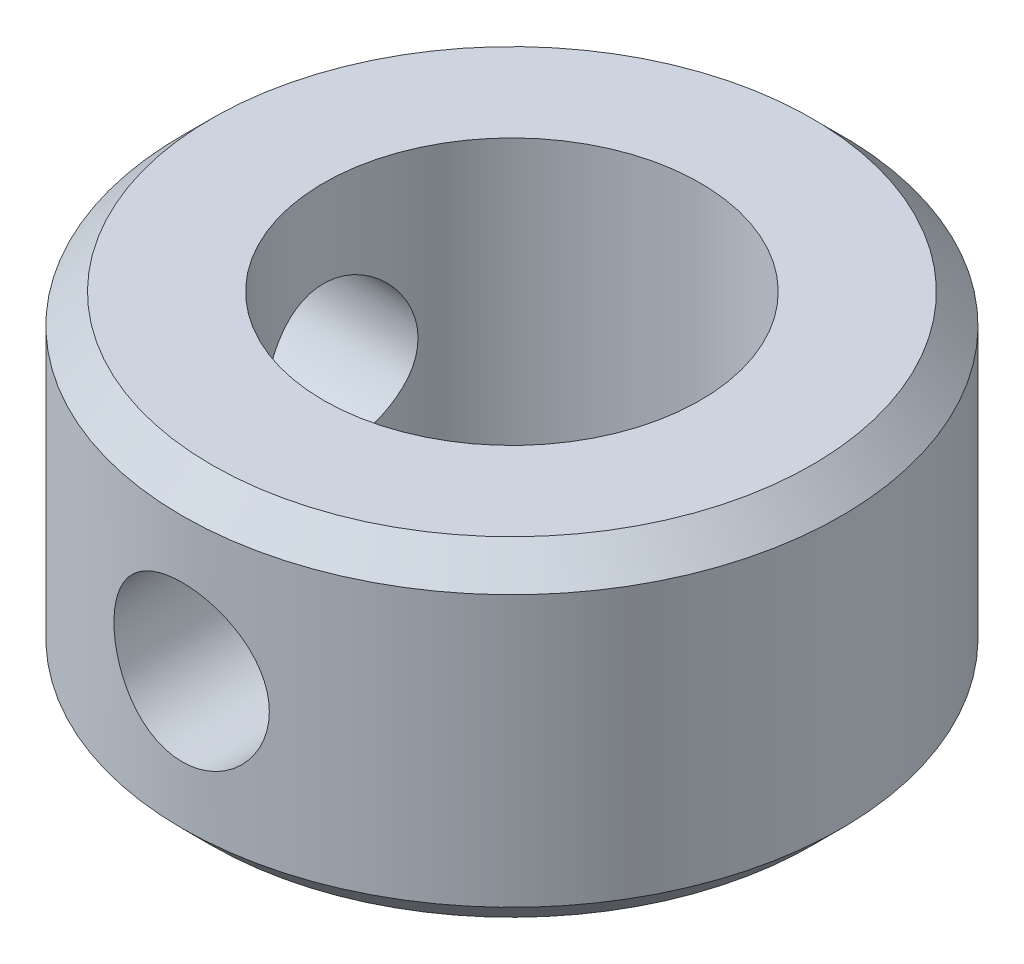
ISO-10303-21;
HEADER;
FILE_DESCRIPTION(('STEP AP214'),'2;1');
FILE_NAME('part.step','',(''),(''),'','','');
FILE_SCHEMA(('AUTOMOTIVE_DESIGN { 1 0 10303 214 1 1 1 1 }'));
ENDSEC;
DATA;
#1=APPLICATION_CONTEXT('core data for automotive mechanical design processes');
#2=APPLICATION_PROTOCOL_DEFINITION('international standard','automotive_design',2000,#1);
#3=PRODUCT_CONTEXT('',#1,'mechanical');
#4=PRODUCT('Part','Part','',(#3));
#5=PRODUCT_RELATED_PRODUCT_CATEGORY('part','',(#4));
#6=PRODUCT_DEFINITION_FORMATION('','',#4);
#7=PRODUCT_DEFINITION_CONTEXT('part definition',#1,'design');
#8=PRODUCT_DEFINITION('design','',#6,#7);
#9=PRODUCT_DEFINITION_SHAPE('','',#8);
#10=(LENGTH_UNIT() NAMED_UNIT(*) SI_UNIT(.MILLI.,.METRE.));
#11=(NAMED_UNIT(*) PLANE_ANGLE_UNIT() SI_UNIT($,.RADIAN.));
#12=(NAMED_UNIT(*) SI_UNIT($,.STERADIAN.) SOLID_ANGLE_UNIT());
#13=UNCERTAINTY_MEASURE_WITH_UNIT(LENGTH_MEASURE(1.E-05),#10,'distance_accuracy_value','');
#14=(GEOMETRIC_REPRESENTATION_CONTEXT(3) GLOBAL_UNCERTAINTY_ASSIGNED_CONTEXT((#13)) GLOBAL_UNIT_ASSIGNED_CONTEXT((#10,
#11,#12)) REPRESENTATION_CONTEXT('',''));
#15=CARTESIAN_POINT('',(0.,0.,0.));
#16=DIRECTION('',(0.,0.,1.));
#17=DIRECTION('',(1.,0.,0.));
#18=AXIS2_PLACEMENT_3D('',#15,#16,#17);
#19=CARTESIAN_POINT('',(0.,3.5,0.));
#20=DIRECTION('',(0.,1.,0.));
#21=DIRECTION('',(0.,0.,1.));
#22=AXIS2_PLACEMENT_3D('',#19,#20,#21);
#23=PLANE('',#22);
#24=CARTESIAN_POINT('',(0.,3.5,0.));
#25=DIRECTION('',(0.,1.,0.));
#26=DIRECTION('',(0.,0.,1.));
#27=AXIS2_PLACEMENT_3D('',#24,#25,#26);
#28=CIRCLE('',#27,6.375);
#29=CARTESIAN_POINT('',(0.,3.5,6.375));
#30=VERTEX_POINT('',#29);
#31=EDGE_CURVE('E10',#30,#30,#28,.T.);
#32=ORIENTED_EDGE('',*,*,#31,.T.);
#33=EDGE_LOOP('',(#32));
#34=FACE_BOUND('',#33,.T.);
#35=CARTESIAN_POINT('',(0.,3.5,0.));
#36=DIRECTION('',(0.,1.,0.));
#37=DIRECTION('',(0.,0.,1.));
#38=AXIS2_PLACEMENT_3D('',#35,#36,#37);
#39=CIRCLE('',#38,4.);
#40=CARTESIAN_POINT('',(0.,3.5,4.));
#41=VERTEX_POINT('',#40);
#42=EDGE_CURVE('E68',#41,#41,#39,.T.);
#43=ORIENTED_EDGE('',*,*,#42,.F.);
#44=EDGE_LOOP('',(#43));
#45=FACE_BOUND('',#44,.T.);
#46=ADVANCED_FACE('F47',(#34,#45),#23,.T.);
#47=CARTESIAN_POINT('',(0.,-3.5,0.));
#48=DIRECTION('',(0.,1.,0.));
#49=DIRECTION('',(0.,0.,1.));
#50=AXIS2_PLACEMENT_3D('',#47,#48,#49);
#51=PLANE('',#50);
#52=CARTESIAN_POINT('',(0.,-3.5,0.));
#53=DIRECTION('',(0.,1.,0.));
#54=DIRECTION('',(0.,0.,1.));
#55=AXIS2_PLACEMENT_3D('',#52,#53,#54);
#56=CIRCLE('',#55,6.375);
#57=CARTESIAN_POINT('',(0.,-3.5,6.375));
#58=VERTEX_POINT('',#57);
#59=EDGE_CURVE('E55',#58,#58,#56,.F.);
#60=ORIENTED_EDGE('',*,*,#59,.T.);
#61=EDGE_LOOP('',(#60));
#62=FACE_BOUND('',#61,.T.);
#63=CARTESIAN_POINT('',(0.,-3.5,0.));
#64=DIRECTION('',(0.,1.,0.));
#65=DIRECTION('',(0.,0.,1.));
#66=AXIS2_PLACEMENT_3D('',#63,#64,#65);
#67=CIRCLE('',#66,4.);
#68=CARTESIAN_POINT('',(0.,-3.5,4.));
#69=VERTEX_POINT('',#68);
#70=EDGE_CURVE('E69',#69,#69,#67,.T.);
#71=ORIENTED_EDGE('',*,*,#70,.T.);
#72=EDGE_LOOP('',(#71));
#73=FACE_BOUND('',#72,.T.);
#74=ADVANCED_FACE('F107',(#62,#73),#51,.F.);
#75=CARTESIAN_POINT('',(0.,3.5,0.));
#76=DIRECTION('',(0.,-1.,0.));
#77=DIRECTION('',(0.,0.,-1.));
#78=AXIS2_PLACEMENT_3D('',#75,#76,#77);
#79=CYLINDRICAL_SURFACE('',#78,7.);
#80=CARTESIAN_POINT('',(-6.80275679412399,0.,1.64999999999998));
#81=CARTESIAN_POINT('',(-6.80275861136206,-0.0912890000234779,1.64999713007314));
#82=CARTESIAN_POINT('',(-6.80461440498174,-0.182610998381094,1.64239813439993));
#83=CARTESIAN_POINT('',(-6.81182064992734,-0.362644563434028,1.61224414767595));
#84=CARTESIAN_POINT('',(-6.81717336620826,-0.451354399288549,1.58967946321203));
#85=CARTESIAN_POINT('',(-6.83073431325552,-0.623533512523368,1.53035515036091));
#86=CARTESIAN_POINT('',(-6.83893911932178,-0.707008933959494,1.49361254058447));
#87=CARTESIAN_POINT('',(-6.85727558075245,-0.866616532790047,1.40702581854955));
#88=CARTESIAN_POINT('',(-6.86740726130098,-0.942748614187931,1.35718153504988));
#89=CARTESIAN_POINT('',(-6.88867782513988,-1.08699982868594,1.24476461908349));
#90=CARTESIAN_POINT('',(-6.89983131541128,-1.15495404527719,1.18198309355865));
#91=CARTESIAN_POINT('',(-6.92176152937785,-1.27947171170117,1.04592427298926));
#92=CARTESIAN_POINT('',(-6.93253822068664,-1.33603418437752,0.972646078487472));
#93=CARTESIAN_POINT('',(-6.95266103704035,-1.43682696981727,0.816555491676971));
#94=CARTESIAN_POINT('',(-6.96198791366554,-1.48089686123284,0.73363681447964));
#95=CARTESIAN_POINT('',(-6.97799434603916,-1.55441290827776,0.561312838562611));
#96=CARTESIAN_POINT('',(-6.98467424785277,-1.58386097569016,0.471908389601348));
#97=CARTESIAN_POINT('',(-6.99453084372035,-1.62677370217112,0.29086802205239));
#98=CARTESIAN_POINT('',(-6.99776875317269,-1.64051799396695,0.199301775715435));
#99=CARTESIAN_POINT('',(-7.00058928212562,-1.65250913676126,0.015109783907853));
#100=CARTESIAN_POINT('',(-7.00017238432294,-1.65075803426303,-0.0775158200378599));
#101=CARTESIAN_POINT('',(-6.99577641572093,-1.63201259498984,-0.259263367840057));
#102=CARTESIAN_POINT('',(-6.99186783471482,-1.61531988499546,-0.348418380319093));
#103=CARTESIAN_POINT('',(-6.98100889430398,-1.56764792556426,-0.522624624983785));
#104=CARTESIAN_POINT('',(-6.97405838372646,-1.53666796609913,-0.607675652983124));
#105=CARTESIAN_POINT('',(-6.95778608866946,-1.46104622960672,-0.772074386794576));
#106=CARTESIAN_POINT('',(-6.94844521053821,-1.41629382953033,-0.851369239725069));
#107=CARTESIAN_POINT('',(-6.92841069918987,-1.31448077411501,-1.00143136070303));
#108=CARTESIAN_POINT('',(-6.91771685448099,-1.25741819349895,-1.07219729215005));
#109=CARTESIAN_POINT('',(-6.89584251761334,-1.13097547490599,-1.20498965605835));
#110=CARTESIAN_POINT('',(-6.88465650871199,-1.06133150430551,-1.26676421005728));
#111=CARTESIAN_POINT('',(-6.8632971795881,-0.912555678850197,-1.37780936391996));
#112=CARTESIAN_POINT('',(-6.85312389657327,-0.83342347563159,-1.42707950447268));
#113=CARTESIAN_POINT('',(-6.83492437266262,-0.667464740192945,-1.51185477157776));
#114=CARTESIAN_POINT('',(-6.82690665922474,-0.580609406049146,-1.54730546989211));
#115=CARTESIAN_POINT('',(-6.8140390867396,-0.40193872243084,-1.60302771512783));
#116=CARTESIAN_POINT('',(-6.80918863409246,-0.31012430586923,-1.62330210645791));
#117=CARTESIAN_POINT('',(-6.80332774943588,-0.12646144305076,-1.64769127898041));
#118=CARTESIAN_POINT('',(-6.80222947433875,-0.0346648402699374,-1.65217579860459));
#119=CARTESIAN_POINT('',(-6.80375919481422,0.148364576583741,-1.64586488795027));
#120=CARTESIAN_POINT('',(-6.80638688917232,0.239597435631894,-1.63507069283236));
#121=CARTESIAN_POINT('',(-6.81498886694796,0.417577450747468,-1.59883140460814));
#122=CARTESIAN_POINT('',(-6.82091521063604,0.504369845653747,-1.5735960425171));
#123=CARTESIAN_POINT('',(-6.83540229380027,0.672493686634514,-1.50942069873875));
#124=CARTESIAN_POINT('',(-6.84396331787599,0.753824541593779,-1.47047923644587));
#125=CARTESIAN_POINT('',(-6.86294389007105,0.910299056589382,-1.37920410959567));
#126=CARTESIAN_POINT('',(-6.87339357272798,0.985308184742531,-1.32664621508519));
#127=CARTESIAN_POINT('',(-6.89489755256542,1.12557800629822,-1.20991829013256));
#128=CARTESIAN_POINT('',(-6.90595193742742,1.19083728083161,-1.14574657256201));
#129=CARTESIAN_POINT('',(-6.92771364919943,1.31122298204255,-1.00592681617984));
#130=CARTESIAN_POINT('',(-6.93840801965821,1.36609535547159,-0.930057660220554));
#131=CARTESIAN_POINT('',(-6.95799159344944,1.46231801677791,-0.769965220758971));
#132=CARTESIAN_POINT('',(-6.96688088727282,1.50366898256505,-0.685742356354583));
#133=CARTESIAN_POINT('',(-6.98179887024889,1.57133783893331,-0.511894272134583));
#134=CARTESIAN_POINT('',(-6.98784709878863,1.59775867456761,-0.422310877248057));
#135=CARTESIAN_POINT('',(-6.99648655479454,1.63513286894146,-0.239816201973873));
#136=CARTESIAN_POINT('',(-6.99907837091255,1.64608886147333,-0.146905491020391));
#137=CARTESIAN_POINT('',(-7.00049202890772,1.65208813057133,0.0372082467747126));
#138=CARTESIAN_POINT('',(-6.9994031706394,1.64750832426096,0.128398504210663));
#139=CARTESIAN_POINT('',(-6.99377268350157,1.62341975270527,0.308670729816493));
#140=CARTESIAN_POINT('',(-6.98923113721447,1.60391134452658,0.397752748359306));
#141=CARTESIAN_POINT('',(-6.97721604451342,1.55071176108928,0.570933576895618));
#142=CARTESIAN_POINT('',(-6.96975517685192,1.51708187051132,0.655052149359122));
#143=CARTESIAN_POINT('',(-6.95269208722048,1.4366509910792,0.816498795364736));
#144=CARTESIAN_POINT('',(-6.94308962308136,1.38984851252764,0.893826099578973));
#145=CARTESIAN_POINT('',(-6.92252474173611,1.28321390355334,1.0413072599721));
#146=CARTESIAN_POINT('',(-6.91153737485731,1.22312153020512,1.11126948147332));
#147=CARTESIAN_POINT('',(-6.88956325338245,1.09212760248887,1.24024523339419));
#148=CARTESIAN_POINT('',(-6.8785764996075,1.02122338274089,1.29925605605593));
#149=CARTESIAN_POINT('',(-6.85764827463158,0.869245406144731,1.40557849643648));
#150=CARTESIAN_POINT('',(-6.84772646444862,0.788026388521302,1.4526866153972));
#151=CARTESIAN_POINT('',(-6.83030721412674,0.618602666246867,1.53250931126196));
#152=CARTESIAN_POINT('',(-6.8228078728753,0.530403507505555,1.56523518241756));
#153=CARTESIAN_POINT('',(-6.81235745600282,0.368530845590517,1.61002842680634));
#154=CARTESIAN_POINT('',(-6.80878274857868,0.295683995155681,1.62498700416514));
#155=CARTESIAN_POINT('',(-6.80398175593831,0.148565318467718,1.64497362976396));
#156=CARTESIAN_POINT('',(-6.80275531520392,0.0742935869089511,1.65000233562813));
#157=CARTESIAN_POINT('',(-6.80275679412399,0.,1.64999999999998));
#158=B_SPLINE_CURVE_WITH_KNOTS('',3,(#80,#81,#82,#83,#84,#85,#86,#87,#88,#89,#90,#91,#92,#93,
#94,#95,#96,#97,#98,#99,#100,#101,#102,#103,#104,#105,#106,#107,#108,#109,#110,#111,#112,#113,
#114,#115,#116,#117,#118,#119,#120,#121,#122,#123,#124,#125,#126,#127,#128,#129,#130,#131,#132,
#133,#134,#135,#136,#137,#138,#139,#140,#141,#142,#143,#144,#145,#146,#147,#148,#149,#150,#151,
#152,#153,#154,#155,#156,#157),.UNSPECIFIED.,.T.,.F.,(4,2,2,2,2,2,2,2,2,2,2,2,2,2,2,2,2,2,2,2,2,
2,2,2,2,2,2,2,2,2,2,2,2,2,2,2,2,2,4),(0.,0.273594440399258,0.547366263700774,0.820810479503744,
1.0942582694491,1.37252656286893,1.65081871531698,1.93253747960749,2.21421939985748,
2.49080324523182,2.76735056224876,3.03843805884697,3.30953902903524,3.5828770280852,
3.85625780745004,4.13623055025586,4.41621357550839,4.69728844125184,4.97831061353603,
5.25270687968443,5.52708096437946,5.79756789407088,6.06808405216623,6.34337456664896,
6.61870510445458,6.90008328124663,7.18144734868653,7.46084693391317,7.74019892930651,
8.01282246332762,8.28543947686365,8.55688541369867,8.82836206089266,9.10571835709369,
9.38314313916058,9.66503130549495,9.9466977102697,10.1693714016501,10.3920303455577),.UNSPECIFIED.);
#159=CARTESIAN_POINT('',(-6.80275679412399,0.,1.64999999999998));
#160=VERTEX_POINT('',#159);
#161=EDGE_CURVE('E123',#160,#160,#158,.T.);
#162=ORIENTED_EDGE('',*,*,#161,.T.);
#163=EDGE_LOOP('',(#162));
#164=FACE_BOUND('',#163,.T.);
#165=CARTESIAN_POINT('',(0.,-2.87500000000001,0.));
#166=DIRECTION('',(0.,1.,0.));
#167=DIRECTION('',(0.,0.,1.));
#168=AXIS2_PLACEMENT_3D('',#165,#166,#167);
#169=CIRCLE('',#168,7.);
#170=CARTESIAN_POINT('',(0.,-2.87500000000001,7.));
#171=VERTEX_POINT('',#170);
#172=EDGE_CURVE('E59',#171,#171,#169,.T.);
#173=ORIENTED_EDGE('',*,*,#172,.T.);
#174=EDGE_LOOP('',(#173));
#175=FACE_BOUND('',#174,.T.);
#176=CARTESIAN_POINT('',(0.,2.875,0.));
#177=DIRECTION('',(0.,1.,0.));
#178=DIRECTION('',(0.,0.,1.));
#179=AXIS2_PLACEMENT_3D('',#176,#177,#178);
#180=CIRCLE('',#179,7.);
#181=CARTESIAN_POINT('',(0.,2.875,7.));
#182=VERTEX_POINT('',#181);
#183=EDGE_CURVE('E63',#182,#182,#180,.F.);
#184=ORIENTED_EDGE('',*,*,#183,.T.);
#185=EDGE_LOOP('',(#184));
#186=FACE_BOUND('',#185,.T.);
#187=CARTESIAN_POINT('',(1.65,0.,6.80275679412398));
#188=CARTESIAN_POINT('',(1.64999713007316,-0.0912890000234778,6.80275861136205));
#189=CARTESIAN_POINT('',(1.64239813439995,-0.182610998381094,6.80461440498174));
#190=CARTESIAN_POINT('',(1.61224414767597,-0.362644563434028,6.81182064992733));
#191=CARTESIAN_POINT('',(1.58967946321205,-0.451354399288548,6.81717336620826));
#192=CARTESIAN_POINT('',(1.53035515036094,-0.623533512523368,6.83073431325551));
#193=CARTESIAN_POINT('',(1.49361254058449,-0.707008933959494,6.83893911932177));
#194=CARTESIAN_POINT('',(1.40702581854958,-0.866616532790047,6.85727558075245));
#195=CARTESIAN_POINT('',(1.3571815350499,-0.94274861418793,6.86740726130097));
#196=CARTESIAN_POINT('',(1.24476461908352,-1.08699982868594,6.88867782513987));
#197=CARTESIAN_POINT('',(1.18198309355868,-1.15495404527719,6.89983131541127));
#198=CARTESIAN_POINT('',(1.04592427298928,-1.27947171170116,6.92176152937784));
#199=CARTESIAN_POINT('',(0.972646078487497,-1.33603418437752,6.93253822068664));
#200=CARTESIAN_POINT('',(0.816555491676995,-1.43682696981727,6.95266103704034));
#201=CARTESIAN_POINT('',(0.733636814479665,-1.48089686123284,6.96198791366554));
#202=CARTESIAN_POINT('',(0.561312838562636,-1.55441290827776,6.97799434603916));
#203=CARTESIAN_POINT('',(0.471908389601373,-1.58386097569016,6.98467424785277));
#204=CARTESIAN_POINT('',(0.290868022052415,-1.62677370217112,6.99453084372035));
#205=CARTESIAN_POINT('',(0.199301775715461,-1.64051799396695,6.99776875317269));
#206=CARTESIAN_POINT('',(0.0151097839078784,-1.65250913676126,7.00058928212562));
#207=CARTESIAN_POINT('',(-0.0775158200378344,-1.65075803426303,7.00017238432294));
#208=CARTESIAN_POINT('',(-0.259263367840032,-1.63201259498984,6.99577641572093));
#209=CARTESIAN_POINT('',(-0.348418380319068,-1.61531988499546,6.99186783471482));
#210=CARTESIAN_POINT('',(-0.52262462498376,-1.56764792556427,6.98100889430398));
#211=CARTESIAN_POINT('',(-0.607675652983099,-1.53666796609913,6.97405838372646));
#212=CARTESIAN_POINT('',(-0.77207438679455,-1.46104622960672,6.95778608866946));
#213=CARTESIAN_POINT('',(-0.851369239725044,-1.41629382953033,6.94844521053821));
#214=CARTESIAN_POINT('',(-1.00143136070301,-1.31448077411501,6.92841069918987));
#215=CARTESIAN_POINT('',(-1.07219729215003,-1.25741819349895,6.91771685448099));
#216=CARTESIAN_POINT('',(-1.20498965605832,-1.13097547490599,6.89584251761335));
#217=CARTESIAN_POINT('',(-1.26676421005725,-1.06133150430551,6.88465650871199));
#218=CARTESIAN_POINT('',(-1.37780936391993,-0.912555678850199,6.8632971795881));
#219=CARTESIAN_POINT('',(-1.42707950447265,-0.833423475631591,6.85312389657327));
#220=CARTESIAN_POINT('',(-1.51185477157774,-0.667464740192947,6.83492437266263));
#221=CARTESIAN_POINT('',(-1.54730546989208,-0.580609406049148,6.82690665922475));
#222=CARTESIAN_POINT('',(-1.6030277151278,-0.401938722430842,6.8140390867396));
#223=CARTESIAN_POINT('',(-1.62330210645788,-0.310124305869232,6.80918863409247));
#224=CARTESIAN_POINT('',(-1.64769127898038,-0.126461443050763,6.80332774943589));
#225=CARTESIAN_POINT('',(-1.65217579860456,-0.0346648402699397,6.80222947433876));
#226=CARTESIAN_POINT('',(-1.64586488795024,0.148364576583739,6.80375919481422));
#227=CARTESIAN_POINT('',(-1.63507069283233,0.239597435631891,6.80638688917233));
#228=CARTESIAN_POINT('',(-1.59883140460811,0.417577450747466,6.81498886694796));
#229=CARTESIAN_POINT('',(-1.57359604251707,0.504369845653746,6.82091521063605));
#230=CARTESIAN_POINT('',(-1.50942069873872,0.672493686634512,6.83540229380027));
#231=CARTESIAN_POINT('',(-1.47047923644584,0.753824541593777,6.84396331787599));
#232=CARTESIAN_POINT('',(-1.37920410959564,0.91029905658938,6.86294389007106));
#233=CARTESIAN_POINT('',(-1.32664621508517,0.98530818474253,6.87339357272798));
#234=CARTESIAN_POINT('',(-1.20991829013253,1.12557800629822,6.89489755256543));
#235=CARTESIAN_POINT('',(-1.14574657256199,1.19083728083161,6.90595193742742));
#236=CARTESIAN_POINT('',(-1.00592681617982,1.31122298204255,6.92771364919943));
#237=CARTESIAN_POINT('',(-0.930057660220531,1.36609535547159,6.93840801965821));
#238=CARTESIAN_POINT('',(-0.769965220758949,1.4623180167779,6.95799159344945));
#239=CARTESIAN_POINT('',(-0.68574235635456,1.50366898256505,6.96688088727282));
#240=CARTESIAN_POINT('',(-0.511894272134561,1.57133783893331,6.98179887024889));
#241=CARTESIAN_POINT('',(-0.422310877248035,1.59775867456761,6.98784709878863));
#242=CARTESIAN_POINT('',(-0.239816201973852,1.63513286894146,6.99648655479454));
#243=CARTESIAN_POINT('',(-0.146905491020369,1.64608886147333,6.99907837091255));
#244=CARTESIAN_POINT('',(0.0372082467747346,1.65208813057133,7.00049202890772));
#245=CARTESIAN_POINT('',(0.128398504210685,1.64750832426096,6.9994031706394));
#246=CARTESIAN_POINT('',(0.308670729816515,1.62341975270527,6.99377268350157));
#247=CARTESIAN_POINT('',(0.397752748359328,1.60391134452658,6.98923113721447));
#248=CARTESIAN_POINT('',(0.57093357689564,1.55071176108928,6.97721604451341));
#249=CARTESIAN_POINT('',(0.655052149359144,1.51708187051132,6.96975517685192));
#250=CARTESIAN_POINT('',(0.816498795364758,1.4366509910792,6.95269208722048));
#251=CARTESIAN_POINT('',(0.893826099578996,1.38984851252764,6.94308962308136));
#252=CARTESIAN_POINT('',(1.04130725997212,1.28321390355334,6.92252474173611));
#253=CARTESIAN_POINT('',(1.11126948147334,1.22312153020512,6.91153737485731));
#254=CARTESIAN_POINT('',(1.24024523339421,1.09212760248887,6.88956325338245));
#255=CARTESIAN_POINT('',(1.29925605605595,1.02122338274089,6.87857649960749));
#256=CARTESIAN_POINT('',(1.40557849643651,0.869245406144734,6.85764827463158));
#257=CARTESIAN_POINT('',(1.45268661539722,0.788026388521305,6.84772646444862));
#258=CARTESIAN_POINT('',(1.53250931126199,0.61860266624687,6.83030721412674));
#259=CARTESIAN_POINT('',(1.56523518241758,0.530403507505558,6.82280787287529));
#260=CARTESIAN_POINT('',(1.61002842680637,0.36853084559052,6.81235745600281));
#261=CARTESIAN_POINT('',(1.62498700416516,0.295683995155683,6.80878274857867));
#262=CARTESIAN_POINT('',(1.64497362976398,0.148565318467719,6.8039817559383));
#263=CARTESIAN_POINT('',(1.65000233562816,0.0742935869089515,6.80275531520391));
#264=CARTESIAN_POINT('',(1.65,0.,6.80275679412398));
#265=B_SPLINE_CURVE_WITH_KNOTS('',3,(#187,#188,#189,#190,#191,#192,#193,#194,#195,#196,#197,
#198,#199,#200,#201,#202,#203,#204,#205,#206,#207,#208,#209,#210,#211,#212,#213,#214,#215,#216,
#217,#218,#219,#220,#221,#222,#223,#224,#225,#226,#227,#228,#229,#230,#231,#232,#233,#234,#235,
#236,#237,#238,#239,#240,#241,#242,#243,#244,#245,#246,#247,#248,#249,#250,#251,#252,#253,#254,
#255,#256,#257,#258,#259,#260,#261,#262,#263,#264),.UNSPECIFIED.,.T.,.F.,(4,2,2,2,2,2,2,2,2,2,2,
2,2,2,2,2,2,2,2,2,2,2,2,2,2,2,2,2,2,2,2,2,2,2,2,2,2,2,4),(0.,0.273594440399257,
0.547366263700773,0.820810479503744,1.0942582694491,1.37252656286893,1.65081871531698,
1.93253747960749,2.21421939985748,2.49080324523182,2.76735056224876,3.03843805884696,
3.30953902903524,3.5828770280852,3.85625780745004,4.13623055025586,4.41621357550839,
4.69728844125184,4.97831061353603,5.25270687968443,5.52708096437946,5.79756789407088,
6.06808405216623,6.34337456664896,6.61870510445458,6.90008328124663,7.18144734868653,
7.46084693391317,7.74019892930651,8.01282246332762,8.28543947686366,8.55688541369867,
8.82836206089266,9.10571835709369,9.38314313916058,9.66503130549495,9.9466977102697,
10.1693714016501,10.3920303455577),.UNSPECIFIED.);
#266=CARTESIAN_POINT('',(1.65,0.,6.80275679412398));
#267=VERTEX_POINT('',#266);
#268=EDGE_CURVE('E72',#267,#267,#265,.T.);
#269=ORIENTED_EDGE('',*,*,#268,.T.);
#270=EDGE_LOOP('',(#269));
#271=FACE_BOUND('',#270,.T.);
#272=ADVANCED_FACE('F88',(#164,#175,#186,#271),#79,.T.);
#273=CARTESIAN_POINT('',(0.,3.5,0.));
#274=DIRECTION('',(0.,-1.,0.));
#275=DIRECTION('',(0.,0.,-1.));
#276=AXIS2_PLACEMENT_3D('',#273,#274,#275);
#277=CYLINDRICAL_SURFACE('',#276,4.);
#278=CARTESIAN_POINT('',(-3.64383040220042,0.,1.64999999999999));
#279=CARTESIAN_POINT('',(-3.64383945275153,-0.0880964802256836,1.64999056813101));
#280=CARTESIAN_POINT('',(-3.64707173267574,-0.176340431973594,1.64289989177357));
#281=CARTESIAN_POINT('',(-3.65959209124688,-0.35028706107888,1.61480845546372));
#282=CARTESIAN_POINT('',(-3.66889676295875,-0.435982100597603,1.59376957896339));
#283=CARTESIAN_POINT('',(-3.69231325052126,-0.602002938130633,1.53873536249637));
#284=CARTESIAN_POINT('',(-3.70640571161012,-0.682348820218598,1.50479212400172));
#285=CARTESIAN_POINT('',(-3.73778230052357,-0.836181766834224,1.42506535594205));
#286=CARTESIAN_POINT('',(-3.75506562873473,-0.909670542784035,1.37928479159594));
#287=CARTESIAN_POINT('',(-3.79205530418551,-1.0522286878465,1.2741985629037));
#288=CARTESIAN_POINT('',(-3.8118427770478,-1.12082925578021,1.21428518241358));
#289=CARTESIAN_POINT('',(-3.85094363418238,-1.24735477190876,1.08391072165481));
#290=CARTESIAN_POINT('',(-3.87025683535297,-1.30527565147222,1.01344563996363));
#291=CARTESIAN_POINT('',(-3.90721575035943,-1.41117137130186,0.860301943593368));
#292=CARTESIAN_POINT('',(-3.92475616703248,-1.45862093270616,0.777232390113576));
#293=CARTESIAN_POINT('',(-3.95520283117798,-1.5386701453217,0.603436361875843));
#294=CARTESIAN_POINT('',(-3.96811109652272,-1.57127626434656,0.512713242513031));
#295=CARTESIAN_POINT('',(-3.98726403378776,-1.61902070665623,0.331105172304384));
#296=CARTESIAN_POINT('',(-3.99381564337609,-1.63496684792323,0.240465625184478));
#297=CARTESIAN_POINT('',(-4.0006306156112,-1.65154665185517,0.0575763551498512));
#298=CARTESIAN_POINT('',(-4.00089647540932,-1.65218639532201,-0.0346727137709691));
#299=CARTESIAN_POINT('',(-3.99529224160632,-1.63856350386341,-0.212297380895999));
#300=CARTESIAN_POINT('',(-3.98978733384658,-1.6251878162829,-0.297754665400411));
#301=CARTESIAN_POINT('',(-3.97375926025944,-1.58543118255224,-0.465085845235293));
#302=CARTESIAN_POINT('',(-3.96323572489496,-1.55904927870932,-0.546959476205506));
#303=CARTESIAN_POINT('',(-3.93798907731602,-1.49371233827982,-0.706295606817243));
#304=CARTESIAN_POINT('',(-3.92320447216362,-1.45457201007513,-0.783671979762483));
#305=CARTESIAN_POINT('',(-3.89088763760773,-1.3650087208134,-0.930960489992479));
#306=CARTESIAN_POINT('',(-3.87335444442336,-1.3145817994967,-1.00086999453933));
#307=CARTESIAN_POINT('',(-3.83587133640027,-1.19981176097137,-1.13638530947042));
#308=CARTESIAN_POINT('',(-3.8158381454309,-1.13474658910128,-1.20135746318646));
#309=CARTESIAN_POINT('',(-3.77653142784555,-0.994590333678428,-1.31973838423495));
#310=CARTESIAN_POINT('',(-3.75725818494772,-0.919495550736701,-1.37314286572203));
#311=CARTESIAN_POINT('',(-3.72106607156909,-0.758401596452687,-1.46845339844829));
#312=CARTESIAN_POINT('',(-3.70424107982557,-0.672132428307352,-1.50994179309278));
#313=CARTESIAN_POINT('',(-3.67596385006485,-0.492953328594107,-1.57754508127097));
#314=CARTESIAN_POINT('',(-3.66450786071417,-0.400048086126187,-1.60367071206122));
#315=CARTESIAN_POINT('',(-3.64919091711418,-0.216577104815017,-1.63821320355943));
#316=CARTESIAN_POINT('',(-3.64489111171831,-0.126241698817143,-1.64765569454683));
#317=CARTESIAN_POINT('',(-3.64311980380967,0.0548056296985959,-1.65157101672828));
#318=CARTESIAN_POINT('',(-3.64564601607449,0.145517416059281,-1.64604885780403));
#319=CARTESIAN_POINT('',(-3.6567894436616,0.31880100904947,-1.62112710501828));
#320=CARTESIAN_POINT('',(-3.66501803861664,0.401528179674606,-1.60261202118544));
#321=CARTESIAN_POINT('',(-3.68614612916707,0.56263706437997,-1.55339580262016));
#322=CARTESIAN_POINT('',(-3.69904670212356,0.641017771351657,-1.52269185697124));
#323=CARTESIAN_POINT('',(-3.72872477858182,0.794879005695636,-1.44853902204986));
#324=CARTESIAN_POINT('',(-3.74564214050945,0.870100194779244,-1.40460979308265));
#325=CARTESIAN_POINT('',(-3.78124523189863,1.01246016942973,-1.30573455409453));
#326=CARTESIAN_POINT('',(-3.79993171387674,1.07959548773512,-1.25078384473685));
#327=CARTESIAN_POINT('',(-3.83876011670653,1.20942962644671,-1.126275421621));
#328=CARTESIAN_POINT('',(-3.85889967217622,1.27135173704872,-1.05590387126705));
#329=CARTESIAN_POINT('',(-3.89698114804694,1.38264285566206,-0.905297980080119));
#330=CARTESIAN_POINT('',(-3.91492292631236,1.4320110520032,-0.825063002026919));
#331=CARTESIAN_POINT('',(-3.94668767391886,1.51670413420679,-0.656516816883283));
#332=CARTESIAN_POINT('',(-3.96050313975063,1.55200347500273,-0.568191273870507));
#333=CARTESIAN_POINT('',(-3.98237104121021,1.60699165685874,-0.386140833605193));
#334=CARTESIAN_POINT('',(-3.9904268305481,1.62668958293894,-0.292419112817577));
#335=CARTESIAN_POINT('',(-3.9994889299446,1.64878822892048,-0.109187189544852));
#336=CARTESIAN_POINT('',(-4.00094173424749,1.65228482874194,-0.0198303081186516));
#337=CARTESIAN_POINT('',(-3.99786220239439,1.64481456562972,0.158161739195396));
#338=CARTESIAN_POINT('',(-3.99333087896147,1.63385015000455,0.246797024648464));
#339=CARTESIAN_POINT('',(-3.979024148364,1.59855535786444,0.41770537593586));
#340=CARTESIAN_POINT('',(-3.96943363922013,1.57469555788545,0.500092371627836));
#341=CARTESIAN_POINT('',(-3.94605480923816,1.51479588512001,0.659667355734144));
#342=CARTESIAN_POINT('',(-3.93226568297163,1.47875367521332,0.736854343148728));
#343=CARTESIAN_POINT('',(-3.9010580848376,1.39369547331361,0.887661133732603));
#344=CARTESIAN_POINT('',(-3.8835042391169,1.34416874322707,0.960964214361134));
#345=CARTESIAN_POINT('',(-3.84685709666619,1.23429715321,1.09852932170703));
#346=CARTESIAN_POINT('',(-3.82776324400833,1.17394837691919,1.16278806031648));
#347=CARTESIAN_POINT('',(-3.78859741195738,1.03941247264534,1.28487769945045));
#348=CARTESIAN_POINT('',(-3.76854475207572,0.964572243115063,1.34199767947155));
#349=CARTESIAN_POINT('',(-3.73105419200534,0.805734024318935,1.44296474677329));
#350=CARTESIAN_POINT('',(-3.7136177396712,0.721731008290412,1.48680449811902));
#351=CARTESIAN_POINT('',(-3.68370387904714,0.547271558730106,1.5594444776665));
#352=CARTESIAN_POINT('',(-3.67119480418034,0.456860891908904,1.58834112875232));
#353=CARTESIAN_POINT('',(-3.65281837075147,0.271952855921642,1.63017263567571));
#354=CARTESIAN_POINT('',(-3.64692873900432,0.17747030912313,1.64316103312973));
#355=CARTESIAN_POINT('',(-3.6441405441978,0.0551366863573563,1.64931209329419));
#356=CARTESIAN_POINT('',(-3.64382756923723,0.0275755677149826,1.65000295232159));
#357=CARTESIAN_POINT('',(-3.64383040220042,0.,1.64999999999999));
#358=B_SPLINE_CURVE_WITH_KNOTS('',3,(#278,#279,#280,#281,#282,#283,#284,#285,#286,#287,#288,
#289,#290,#291,#292,#293,#294,#295,#296,#297,#298,#299,#300,#301,#302,#303,#304,#305,#306,#307,
#308,#309,#310,#311,#312,#313,#314,#315,#316,#317,#318,#319,#320,#321,#322,#323,#324,#325,#326,
#327,#328,#329,#330,#331,#332,#333,#334,#335,#336,#337,#338,#339,#340,#341,#342,#343,#344,#345,
#346,#347,#348,#349,#350,#351,#352,#353,#354,#355,#356,#357),.UNSPECIFIED.,.T.,.F.,(4,2,2,2,2,2,
2,2,2,2,2,2,2,2,2,2,2,2,2,2,2,2,2,2,2,2,2,2,2,2,2,2,2,2,2,2,2,2,2,4),(0.,0.264211724660744,
0.529148459018597,0.793026677872048,1.05683885985756,1.33523297260792,1.61373292676209,
1.90403076094908,2.19420198072699,2.4695381624427,2.74476495901024,3.00356896819766,
3.26239203686791,3.5251552692474,3.78801084539545,4.06907613148064,4.35024537535724,
4.64031806272423,4.9301877724111,5.20152035698263,5.47276211576042,5.72713321026166,
5.9815630002888,6.24665916965708,6.51186861189123,6.79815687284346,7.08446363898863,
7.3712879145617,7.6579450434915,7.92489841526079,8.19180661499934,8.44957452423759,
8.70739191275387,8.97680852354694,9.24632283025306,9.53374725602175,9.82133016535515,
10.1070334851925,10.3917725616094,10.4744749384332),.UNSPECIFIED.);
#359=CARTESIAN_POINT('',(-3.64383040220042,0.,1.64999999999999));
#360=VERTEX_POINT('',#359);
#361=EDGE_CURVE('E213',#360,#360,#358,.T.);
#362=ORIENTED_EDGE('',*,*,#361,.F.);
#363=EDGE_LOOP('',(#362));
#364=FACE_BOUND('',#363,.T.);
#365=CARTESIAN_POINT('',(1.65,0.,3.64383040220041));
#366=CARTESIAN_POINT('',(1.64999056813102,-0.0880964802256835,3.64383945275153));
#367=CARTESIAN_POINT('',(1.64289989177358,-0.176340431973594,3.64707173267573));
#368=CARTESIAN_POINT('',(1.61480845546373,-0.35028706107888,3.65959209124688));
#369=CARTESIAN_POINT('',(1.5937695789634,-0.435982100597603,3.66889676295874));
#370=CARTESIAN_POINT('',(1.53873536249638,-0.602002938130633,3.69231325052126));
#371=CARTESIAN_POINT('',(1.50479212400174,-0.682348820218598,3.70640571161012));
#372=CARTESIAN_POINT('',(1.42506535594207,-0.836181766834224,3.73778230052357));
#373=CARTESIAN_POINT('',(1.37928479159595,-0.909670542784035,3.75506562873473));
#374=CARTESIAN_POINT('',(1.27419856290371,-1.0522286878465,3.7920553041855));
#375=CARTESIAN_POINT('',(1.2142851824136,-1.12082925578021,3.81184277704779));
#376=CARTESIAN_POINT('',(1.08391072165483,-1.24735477190876,3.85094363418238));
#377=CARTESIAN_POINT('',(1.01344563996364,-1.30527565147222,3.87025683535296));
#378=CARTESIAN_POINT('',(0.860301943593381,-1.41117137130186,3.90721575035942));
#379=CARTESIAN_POINT('',(0.77723239011359,-1.45862093270616,3.92475616703248));
#380=CARTESIAN_POINT('',(0.603436361875856,-1.5386701453217,3.95520283117798));
#381=CARTESIAN_POINT('',(0.512713242513044,-1.57127626434656,3.96811109652272));
#382=CARTESIAN_POINT('',(0.331105172304398,-1.61902070665623,3.98726403378776));
#383=CARTESIAN_POINT('',(0.240465625184492,-1.63496684792324,3.99381564337609));
#384=CARTESIAN_POINT('',(0.0575763551498645,-1.65154665185517,4.0006306156112));
#385=CARTESIAN_POINT('',(-0.0346727137709559,-1.65218639532201,4.00089647540932));
#386=CARTESIAN_POINT('',(-0.212297380895986,-1.63856350386341,3.99529224160632));
#387=CARTESIAN_POINT('',(-0.297754665400398,-1.6251878162829,3.98978733384658));
#388=CARTESIAN_POINT('',(-0.46508584523528,-1.58543118255224,3.97375926025944));
#389=CARTESIAN_POINT('',(-0.546959476205493,-1.55904927870932,3.96323572489496));
#390=CARTESIAN_POINT('',(-0.70629560681723,-1.49371233827982,3.93798907731603));
#391=CARTESIAN_POINT('',(-0.78367197976247,-1.45457201007513,3.92320447216362));
#392=CARTESIAN_POINT('',(-0.930960489992467,-1.3650087208134,3.89088763760773));
#393=CARTESIAN_POINT('',(-1.00086999453932,-1.3145817994967,3.87335444442336));
#394=CARTESIAN_POINT('',(-1.13638530947041,-1.19981176097137,3.83587133640027));
#395=CARTESIAN_POINT('',(-1.20135746318645,-1.13474658910128,3.8158381454309));
#396=CARTESIAN_POINT('',(-1.31973838423493,-0.994590333678427,3.77653142784555));
#397=CARTESIAN_POINT('',(-1.37314286572202,-0.9194955507367,3.75725818494773));
#398=CARTESIAN_POINT('',(-1.46845339844828,-0.758401596452686,3.72106607156909));
#399=CARTESIAN_POINT('',(-1.50994179309277,-0.672132428307351,3.70424107982558));
#400=CARTESIAN_POINT('',(-1.57754508127096,-0.492953328594106,3.67596385006485));
#401=CARTESIAN_POINT('',(-1.60367071206121,-0.400048086126186,3.66450786071417));
#402=CARTESIAN_POINT('',(-1.63821320355942,-0.216577104815016,3.64919091711418));
#403=CARTESIAN_POINT('',(-1.64765569454682,-0.126241698817142,3.64489111171831));
#404=CARTESIAN_POINT('',(-1.65157101672826,0.0548056296985968,3.64311980380967));
#405=CARTESIAN_POINT('',(-1.64604885780402,0.145517416059282,3.64564601607449));
#406=CARTESIAN_POINT('',(-1.62112710501826,0.318801009049471,3.65678944366161));
#407=CARTESIAN_POINT('',(-1.60261202118543,0.401528179674607,3.66501803861664));
#408=CARTESIAN_POINT('',(-1.55339580262015,0.562637064379971,3.68614612916707));
#409=CARTESIAN_POINT('',(-1.52269185697123,0.641017771351658,3.69904670212356));
#410=CARTESIAN_POINT('',(-1.44853902204985,0.794879005695637,3.72872477858182));
#411=CARTESIAN_POINT('',(-1.40460979308264,0.870100194779245,3.74564214050945));
#412=CARTESIAN_POINT('',(-1.30573455409451,1.01246016942973,3.78124523189864));
#413=CARTESIAN_POINT('',(-1.25078384473683,1.07959548773512,3.79993171387674));
#414=CARTESIAN_POINT('',(-1.12627542162099,1.20942962644671,3.83876011670653));
#415=CARTESIAN_POINT('',(-1.05590387126704,1.27135173704872,3.85889967217623));
#416=CARTESIAN_POINT('',(-0.905297980080104,1.38264285566206,3.89698114804694));
#417=CARTESIAN_POINT('',(-0.825063002026905,1.4320110520032,3.91492292631236));
#418=CARTESIAN_POINT('',(-0.656516816883268,1.51670413420679,3.94668767391886));
#419=CARTESIAN_POINT('',(-0.568191273870492,1.55200347500273,3.96050313975064));
#420=CARTESIAN_POINT('',(-0.386140833605178,1.60699165685875,3.98237104121021));
#421=CARTESIAN_POINT('',(-0.292419112817561,1.62668958293894,3.9904268305481));
#422=CARTESIAN_POINT('',(-0.109187189544837,1.64878822892048,3.9994889299446));
#423=CARTESIAN_POINT('',(-0.0198303081186367,1.65228482874194,4.00094173424749));
#424=CARTESIAN_POINT('',(0.15816173919541,1.64481456562972,3.99786220239438));
#425=CARTESIAN_POINT('',(0.246797024648479,1.63385015000455,3.99333087896147));
#426=CARTESIAN_POINT('',(0.417705375935875,1.59855535786444,3.979024148364));
#427=CARTESIAN_POINT('',(0.50009237162785,1.57469555788545,3.96943363922013));
#428=CARTESIAN_POINT('',(0.659667355734159,1.51479588512001,3.94605480923816));
#429=CARTESIAN_POINT('',(0.736854343148743,1.47875367521332,3.93226568297163));
#430=CARTESIAN_POINT('',(0.887661133732618,1.39369547331361,3.90105808483759));
#431=CARTESIAN_POINT('',(0.960964214361149,1.34416874322707,3.88350423911689));
#432=CARTESIAN_POINT('',(1.09852932170704,1.23429715321,3.84685709666619));
#433=CARTESIAN_POINT('',(1.1627880603165,1.17394837691919,3.82776324400832));
#434=CARTESIAN_POINT('',(1.28487769945047,1.03941247264534,3.78859741195738));
#435=CARTESIAN_POINT('',(1.34199767947157,0.964572243115062,3.76854475207571));
#436=CARTESIAN_POINT('',(1.4429647467733,0.805734024318934,3.73105419200534));
#437=CARTESIAN_POINT('',(1.48680449811903,0.721731008290411,3.7136177396712));
#438=CARTESIAN_POINT('',(1.55944447766651,0.547271558730105,3.68370387904713));
#439=CARTESIAN_POINT('',(1.58834112875234,0.456860891908903,3.67119480418034));
#440=CARTESIAN_POINT('',(1.63017263567573,0.271952855921641,3.65281837075147));
#441=CARTESIAN_POINT('',(1.64316103312974,0.177470309123129,3.64692873900432));
#442=CARTESIAN_POINT('',(1.6493120932942,0.0551366863573554,3.64414054419779));
#443=CARTESIAN_POINT('',(1.6500029523216,0.0275755677149822,3.64382756923723));
#444=CARTESIAN_POINT('',(1.65,0.,3.64383040220041));
#445=B_SPLINE_CURVE_WITH_KNOTS('',3,(#365,#366,#367,#368,#369,#370,#371,#372,#373,#374,#375,
#376,#377,#378,#379,#380,#381,#382,#383,#384,#385,#386,#387,#388,#389,#390,#391,#392,#393,#394,
#395,#396,#397,#398,#399,#400,#401,#402,#403,#404,#405,#406,#407,#408,#409,#410,#411,#412,#413,
#414,#415,#416,#417,#418,#419,#420,#421,#422,#423,#424,#425,#426,#427,#428,#429,#430,#431,#432,
#433,#434,#435,#436,#437,#438,#439,#440,#441,#442,#443,#444),.UNSPECIFIED.,.T.,.F.,(4,2,2,2,2,2,
2,2,2,2,2,2,2,2,2,2,2,2,2,2,2,2,2,2,2,2,2,2,2,2,2,2,2,2,2,2,2,2,2,4),(0.,0.264211724660744,
0.529148459018597,0.793026677872048,1.05683885985756,1.33523297260792,1.61373292676209,
1.90403076094908,2.19420198072699,2.4695381624427,2.74476495901024,3.00356896819766,
3.26239203686791,3.5251552692474,3.78801084539545,4.06907613148064,4.35024537535724,
4.64031806272423,4.9301877724111,5.20152035698263,5.47276211576042,5.72713321026166,
5.9815630002888,6.24665916965708,6.51186861189123,6.79815687284346,7.08446363898863,
7.3712879145617,7.6579450434915,7.92489841526079,8.19180661499934,8.44957452423759,
8.70739191275387,8.97680852354694,9.24632283025306,9.53374725602174,9.82133016535515,
10.1070334851925,10.3917725616094,10.4744749384332),.UNSPECIFIED.);
#446=CARTESIAN_POINT('',(1.65,0.,3.64383040220041));
#447=VERTEX_POINT('',#446);
#448=EDGE_CURVE('E82',#447,#447,#445,.T.);
#449=ORIENTED_EDGE('',*,*,#448,.F.);
#450=EDGE_LOOP('',(#449));
#451=FACE_BOUND('',#450,.T.);
#452=ORIENTED_EDGE('',*,*,#42,.T.);
#453=EDGE_LOOP('',(#452));
#454=FACE_BOUND('',#453,.T.);
#455=ORIENTED_EDGE('',*,*,#70,.F.);
#456=EDGE_LOOP('',(#455));
#457=FACE_BOUND('',#456,.T.);
#458=ADVANCED_FACE('F96',(#364,#451,#454,#457),#277,.F.);
#459=CARTESIAN_POINT('',(0.,0.,7.));
#460=DIRECTION('',(0.,0.,1.));
#461=DIRECTION('',(1.,0.,0.));
#462=AXIS2_PLACEMENT_3D('',#459,#460,#461);
#463=CYLINDRICAL_SURFACE('',#462,1.65);
#464=ORIENTED_EDGE('',*,*,#448,.T.);
#465=EDGE_LOOP('',(#464));
#466=FACE_BOUND('',#465,.T.);
#467=ORIENTED_EDGE('',*,*,#268,.F.);
#468=EDGE_LOOP('',(#467));
#469=FACE_BOUND('',#468,.T.);
#470=ADVANCED_FACE('F91',(#466,#469),#463,.F.);
#471=CARTESIAN_POINT('',(0.,-2.87500000000001,0.));
#472=DIRECTION('',(0.,1.,0.));
#473=DIRECTION('',(0.,0.,1.));
#474=AXIS2_PLACEMENT_3D('',#471,#472,#473);
#475=CONICAL_SURFACE('',#474,7.,0.785398163397451);
#476=ORIENTED_EDGE('',*,*,#59,.F.);
#477=EDGE_LOOP('',(#476));
#478=FACE_BOUND('',#477,.T.);
#479=ORIENTED_EDGE('',*,*,#172,.F.);
#480=EDGE_LOOP('',(#479));
#481=FACE_BOUND('',#480,.T.);
#482=ADVANCED_FACE('F95',(#478,#481),#475,.T.);
#483=CARTESIAN_POINT('',(0.,3.5,0.));
#484=DIRECTION('',(0.,-1.,0.));
#485=DIRECTION('',(0.,0.,-1.));
#486=AXIS2_PLACEMENT_3D('',#483,#484,#485);
#487=CONICAL_SURFACE('',#486,6.375,0.785398163397447);
#488=ORIENTED_EDGE('',*,*,#183,.F.);
#489=EDGE_LOOP('',(#488));
#490=FACE_BOUND('',#489,.T.);
#491=ORIENTED_EDGE('',*,*,#31,.F.);
#492=EDGE_LOOP('',(#491));
#493=FACE_BOUND('',#492,.T.);
#494=ADVANCED_FACE('F50',(#490,#493),#487,.T.);
#495=CARTESIAN_POINT('',(-7.,0.,0.));
#496=DIRECTION('',(-1.,0.,0.));
#497=DIRECTION('',(0.,0.,1.));
#498=AXIS2_PLACEMENT_3D('',#495,#496,#497);
#499=CYLINDRICAL_SURFACE('',#498,1.65);
#500=ORIENTED_EDGE('',*,*,#361,.T.);
#501=EDGE_LOOP('',(#500));
#502=FACE_BOUND('',#501,.T.);
#503=ORIENTED_EDGE('',*,*,#161,.F.);
#504=EDGE_LOOP('',(#503));
#505=FACE_BOUND('',#504,.T.);
#506=ADVANCED_FACE('F132',(#502,#505),#499,.F.);
#507=CLOSED_SHELL('',(#46,#74,#272,#458,#470,#482,#494,#506));
#508=MANIFOLD_SOLID_BREP('B2',#507);
#509=ADVANCED_BREP_SHAPE_REPRESENTATION('',(#18,#508),#14);
#510=SHAPE_DEFINITION_REPRESENTATION(#9,#509);
ENDSEC;
END-ISO-10303-21;
